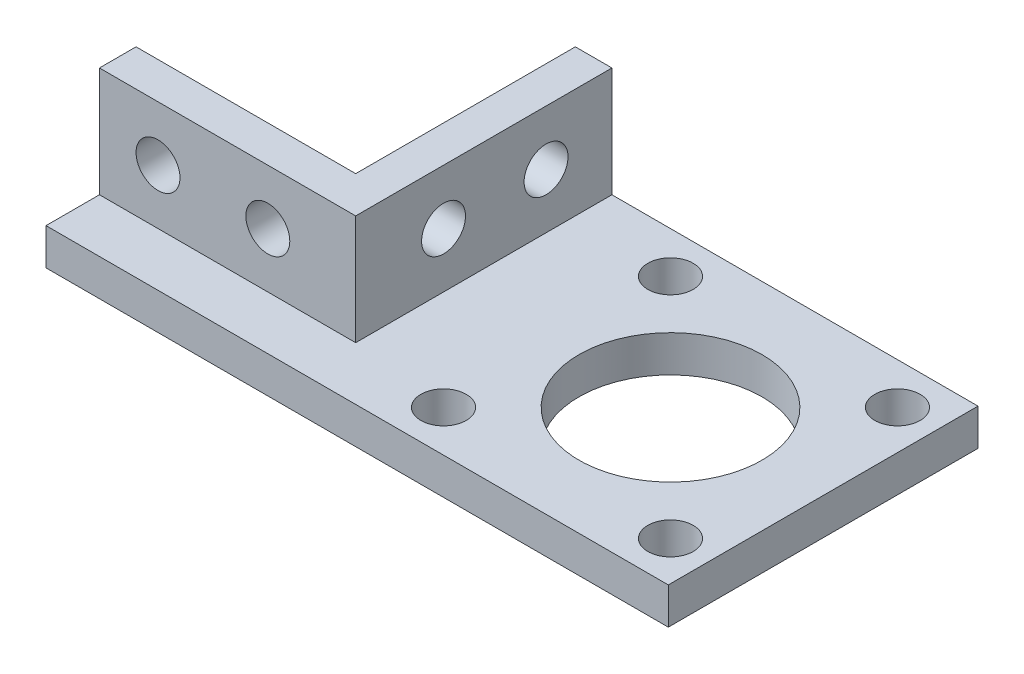
ISO-10303-21;
HEADER;
FILE_DESCRIPTION(('STEP AP214'),'2;1');
FILE_NAME('part.step','',(''),(''),'','','');
FILE_SCHEMA(('AUTOMOTIVE_DESIGN { 1 0 10303 214 1 1 1 1 }'));
ENDSEC;
DATA;
#1=APPLICATION_CONTEXT('core data for automotive mechanical design processes');
#2=APPLICATION_PROTOCOL_DEFINITION('international standard','automotive_design',2000,#1);
#3=PRODUCT_CONTEXT('',#1,'mechanical');
#4=PRODUCT('Part','Part','',(#3));
#5=PRODUCT_RELATED_PRODUCT_CATEGORY('part','',(#4));
#6=PRODUCT_DEFINITION_FORMATION('','',#4);
#7=PRODUCT_DEFINITION_CONTEXT('part definition',#1,'design');
#8=PRODUCT_DEFINITION('design','',#6,#7);
#9=PRODUCT_DEFINITION_SHAPE('','',#8);
#10=(LENGTH_UNIT() NAMED_UNIT(*) SI_UNIT(.MILLI.,.METRE.));
#11=(NAMED_UNIT(*) PLANE_ANGLE_UNIT() SI_UNIT($,.RADIAN.));
#12=(NAMED_UNIT(*) SI_UNIT($,.STERADIAN.) SOLID_ANGLE_UNIT());
#13=UNCERTAINTY_MEASURE_WITH_UNIT(LENGTH_MEASURE(1.E-05),#10,'distance_accuracy_value','');
#14=(GEOMETRIC_REPRESENTATION_CONTEXT(3) GLOBAL_UNCERTAINTY_ASSIGNED_CONTEXT((#13)) GLOBAL_UNIT_ASSIGNED_CONTEXT((#10,
#11,#12)) REPRESENTATION_CONTEXT('',''));
#15=CARTESIAN_POINT('',(0.,0.,0.));
#16=DIRECTION('',(0.,0.,1.));
#17=DIRECTION('',(1.,0.,0.));
#18=AXIS2_PLACEMENT_3D('',#15,#16,#17);
#19=CARTESIAN_POINT('',(0.,0.,5.));
#20=DIRECTION('',(0.,0.,-1.));
#21=DIRECTION('',(-1.,0.,0.));
#22=AXIS2_PLACEMENT_3D('',#19,#20,#21);
#23=PLANE('',#22);
#24=CARTESIAN_POINT('',(-71.2052139280012,-262.5,5.));
#25=DIRECTION('',(0.,0.,1.));
#26=DIRECTION('',(1.,0.,0.));
#27=AXIS2_PLACEMENT_3D('',#24,#25,#26);
#28=CIRCLE('',#27,3.00000000000001);
#29=CARTESIAN_POINT('',(-68.2052139280012,-262.5,5.));
#30=VERTEX_POINT('',#29);
#31=EDGE_CURVE('E169',#30,#30,#28,.T.);
#32=ORIENTED_EDGE('',*,*,#31,.F.);
#33=EDGE_LOOP('',(#32));
#34=FACE_BOUND('',#33,.T.);
#35=CARTESIAN_POINT('',(-86.2052139280012,-262.5,5.));
#36=DIRECTION('',(0.,0.,1.));
#37=DIRECTION('',(1.,0.,0.));
#38=AXIS2_PLACEMENT_3D('',#35,#36,#37);
#39=CIRCLE('',#38,3.00000000000001);
#40=CARTESIAN_POINT('',(-83.2052139280012,-262.5,5.));
#41=VERTEX_POINT('',#40);
#42=EDGE_CURVE('E175',#41,#41,#39,.T.);
#43=ORIENTED_EDGE('',*,*,#42,.F.);
#44=EDGE_LOOP('',(#43));
#45=FACE_BOUND('',#44,.T.);
#46=DIRECTION('',(1.,0.,0.));
#47=VECTOR('',#46,1.);
#48=CARTESIAN_POINT('',(-94.2052139280012,-270.,5.));
#49=LINE('',#48,#47);
#50=CARTESIAN_POINT('',(-94.2052139280012,-270.,5.));
#51=VERTEX_POINT('',#50);
#52=CARTESIAN_POINT('',(-59.2052139280012,-270.,5.));
#53=VERTEX_POINT('',#52);
#54=EDGE_CURVE('E121',#51,#53,#49,.T.);
#55=ORIENTED_EDGE('',*,*,#54,.T.);
#56=DIRECTION('',(0.,1.,0.));
#57=VECTOR('',#56,1.);
#58=CARTESIAN_POINT('',(-59.2052139280012,-275.,5.));
#59=LINE('',#58,#57);
#60=CARTESIAN_POINT('',(-59.2052139280012,-255.,5.));
#61=VERTEX_POINT('',#60);
#62=EDGE_CURVE('E133',#53,#61,#59,.T.);
#63=ORIENTED_EDGE('',*,*,#62,.T.);
#64=DIRECTION('',(-1.,0.,0.));
#65=VECTOR('',#64,1.);
#66=CARTESIAN_POINT('',(-94.2052139280012,-255.,5.));
#67=LINE('',#66,#65);
#68=CARTESIAN_POINT('',(-94.2052139280012,-255.,5.));
#69=VERTEX_POINT('',#68);
#70=EDGE_CURVE('E127',#61,#69,#67,.T.);
#71=ORIENTED_EDGE('',*,*,#70,.T.);
#72=DIRECTION('',(0.,-1.,0.));
#73=VECTOR('',#72,1.);
#74=CARTESIAN_POINT('',(-94.2052139280012,-275.,5.));
#75=LINE('',#74,#73);
#76=EDGE_CURVE('E114',#69,#51,#75,.T.);
#77=ORIENTED_EDGE('',*,*,#76,.T.);
#78=EDGE_LOOP('',(#55,#63,#71,#77));
#79=FACE_BOUND('',#78,.T.);
#80=ADVANCED_FACE('F33',(#34,#45,#79),#23,.F.);
#81=CARTESIAN_POINT('',(-59.2052139280012,-275.,5.));
#82=DIRECTION('',(-1.,0.,0.));
#83=DIRECTION('',(0.,0.,1.));
#84=AXIS2_PLACEMENT_3D('',#81,#82,#83);
#85=PLANE('',#84);
#86=CARTESIAN_POINT('',(-59.2052139280012,-262.5,-20.9999999999999));
#87=DIRECTION('',(1.,0.,0.));
#88=DIRECTION('',(0.,0.,-1.));
#89=AXIS2_PLACEMENT_3D('',#86,#87,#88);
#90=CIRCLE('',#89,3.);
#91=CARTESIAN_POINT('',(-59.2052139280012,-262.5,-23.9999999999999));
#92=VERTEX_POINT('',#91);
#93=EDGE_CURVE('E164',#92,#92,#90,.T.);
#94=ORIENTED_EDGE('',*,*,#93,.F.);
#95=EDGE_LOOP('',(#94));
#96=FACE_BOUND('',#95,.T.);
#97=CARTESIAN_POINT('',(-59.2052139280012,-262.5,-7.));
#98=DIRECTION('',(1.,0.,0.));
#99=DIRECTION('',(0.,0.,-1.));
#100=AXIS2_PLACEMENT_3D('',#97,#98,#99);
#101=CIRCLE('',#100,3.);
#102=CARTESIAN_POINT('',(-59.2052139280012,-262.5,-10.));
#103=VERTEX_POINT('',#102);
#104=EDGE_CURVE('E173',#103,#103,#101,.T.);
#105=ORIENTED_EDGE('',*,*,#104,.F.);
#106=EDGE_LOOP('',(#105));
#107=FACE_BOUND('',#106,.T.);
#108=DIRECTION('',(0.,0.,1.));
#109=VECTOR('',#108,1.);
#110=CARTESIAN_POINT('',(-59.2052139280012,-270.,-29.9999999999999));
#111=LINE('',#110,#109);
#112=CARTESIAN_POINT('',(-59.2052139280012,-270.,-29.9999999999999));
#113=VERTEX_POINT('',#112);
#114=EDGE_CURVE('E50',#113,#53,#111,.T.);
#115=ORIENTED_EDGE('',*,*,#114,.F.);
#116=DIRECTION('',(0.,-1.,0.));
#117=VECTOR('',#116,1.);
#118=CARTESIAN_POINT('',(-59.2052139280012,-275.,-29.9999999999999));
#119=LINE('',#118,#117);
#120=CARTESIAN_POINT('',(-59.2052139280012,-255.,-29.9999999999999));
#121=VERTEX_POINT('',#120);
#122=EDGE_CURVE('E224',#121,#113,#119,.T.);
#123=ORIENTED_EDGE('',*,*,#122,.F.);
#124=DIRECTION('',(0.,0.,-1.));
#125=VECTOR('',#124,1.);
#126=CARTESIAN_POINT('',(-59.2052139280012,-255.,5.));
#127=LINE('',#126,#125);
#128=EDGE_CURVE('E11',#61,#121,#127,.T.);
#129=ORIENTED_EDGE('',*,*,#128,.F.);
#130=ORIENTED_EDGE('',*,*,#62,.F.);
#131=EDGE_LOOP('',(#115,#123,#129,#130));
#132=FACE_BOUND('',#131,.T.);
#133=ADVANCED_FACE('F35',(#96,#107,#132),#85,.F.);
#134=CARTESIAN_POINT('',(-94.2052139280012,-255.,5.));
#135=DIRECTION('',(0.,-1.,0.));
#136=DIRECTION('',(0.,0.,-1.));
#137=AXIS2_PLACEMENT_3D('',#134,#135,#136);
#138=PLANE('',#137);
#139=ORIENTED_EDGE('',*,*,#128,.T.);
#140=DIRECTION('',(1.,0.,0.));
#141=VECTOR('',#140,1.);
#142=CARTESIAN_POINT('',(-64.2052139280012,-255.,-29.9999999999999));
#143=LINE('',#142,#141);
#144=CARTESIAN_POINT('',(-64.2052139280012,-255.,-29.9999999999999));
#145=VERTEX_POINT('',#144);
#146=EDGE_CURVE('E221',#145,#121,#143,.T.);
#147=ORIENTED_EDGE('',*,*,#146,.F.);
#148=DIRECTION('',(0.,0.,1.));
#149=VECTOR('',#148,1.);
#150=CARTESIAN_POINT('',(-64.2052139280012,-255.,-29.9999999999999));
#151=LINE('',#150,#149);
#152=CARTESIAN_POINT('',(-64.2052139280012,-255.,0.));
#153=VERTEX_POINT('',#152);
#154=EDGE_CURVE('E140',#145,#153,#151,.T.);
#155=ORIENTED_EDGE('',*,*,#154,.T.);
#156=DIRECTION('',(-1.,0.,0.));
#157=VECTOR('',#156,1.);
#158=CARTESIAN_POINT('',(-94.2052139280012,-255.,0.));
#159=LINE('',#158,#157);
#160=CARTESIAN_POINT('',(-94.2052139280012,-255.,0.));
#161=VERTEX_POINT('',#160);
#162=EDGE_CURVE('E137',#153,#161,#159,.T.);
#163=ORIENTED_EDGE('',*,*,#162,.T.);
#164=DIRECTION('',(0.,0.,-1.));
#165=VECTOR('',#164,1.);
#166=CARTESIAN_POINT('',(-94.2052139280012,-255.,5.));
#167=LINE('',#166,#165);
#168=EDGE_CURVE('E42',#69,#161,#167,.T.);
#169=ORIENTED_EDGE('',*,*,#168,.F.);
#170=ORIENTED_EDGE('',*,*,#70,.F.);
#171=EDGE_LOOP('',(#139,#147,#155,#163,#169,#170));
#172=FACE_BOUND('',#171,.T.);
#173=ADVANCED_FACE('F235',(#172),#138,.F.);
#174=CARTESIAN_POINT('',(-94.2052139280012,-275.,5.));
#175=DIRECTION('',(1.,0.,0.));
#176=DIRECTION('',(0.,0.,-1.));
#177=AXIS2_PLACEMENT_3D('',#174,#175,#176);
#178=PLANE('',#177);
#179=DIRECTION('',(0.,-1.,0.));
#180=VECTOR('',#179,1.);
#181=CARTESIAN_POINT('',(-94.2052139280012,-275.,0.));
#182=LINE('',#181,#180);
#183=CARTESIAN_POINT('',(-94.2052139280012,-275.,0.));
#184=VERTEX_POINT('',#183);
#185=EDGE_CURVE('E139',#161,#184,#182,.T.);
#186=ORIENTED_EDGE('',*,*,#185,.T.);
#187=DIRECTION('',(0.,0.,-1.));
#188=VECTOR('',#187,1.);
#189=CARTESIAN_POINT('',(-94.2052139280012,-275.,5.));
#190=LINE('',#189,#188);
#191=CARTESIAN_POINT('',(-94.2052139280012,-275.,12.3000000000001));
#192=VERTEX_POINT('',#191);
#193=EDGE_CURVE('E129',#192,#184,#190,.T.);
#194=ORIENTED_EDGE('',*,*,#193,.F.);
#195=DIRECTION('',(0.,1.,0.));
#196=VECTOR('',#195,1.);
#197=CARTESIAN_POINT('',(-94.2052139280012,-275.,12.3000000000001));
#198=LINE('',#197,#196);
#199=CARTESIAN_POINT('',(-94.2052139280012,-270.,12.3000000000001));
#200=VERTEX_POINT('',#199);
#201=EDGE_CURVE('E116',#192,#200,#198,.T.);
#202=ORIENTED_EDGE('',*,*,#201,.T.);
#203=DIRECTION('',(0.,0.,-1.));
#204=VECTOR('',#203,1.);
#205=CARTESIAN_POINT('',(-94.2052139280012,-270.,12.3000000000001));
#206=LINE('',#205,#204);
#207=EDGE_CURVE('E109',#200,#51,#206,.T.);
#208=ORIENTED_EDGE('',*,*,#207,.T.);
#209=ORIENTED_EDGE('',*,*,#76,.F.);
#210=ORIENTED_EDGE('',*,*,#168,.T.);
#211=EDGE_LOOP('',(#186,#194,#202,#208,#209,#210));
#212=FACE_BOUND('',#211,.T.);
#213=ADVANCED_FACE('F111',(#212),#178,.F.);
#214=CARTESIAN_POINT('',(-94.2052139280012,-275.,5.));
#215=DIRECTION('',(0.,1.,0.));
#216=DIRECTION('',(0.,0.,1.));
#217=AXIS2_PLACEMENT_3D('',#214,#215,#216);
#218=PLANE('',#217);
#219=CARTESIAN_POINT('',(-45.5552139280007,-275.,-24.3499999999999));
#220=DIRECTION('',(0.,-1.,0.));
#221=DIRECTION('',(0.,0.,-1.));
#222=AXIS2_PLACEMENT_3D('',#219,#220,#221);
#223=CIRCLE('',#222,3.10000000000003);
#224=CARTESIAN_POINT('',(-45.5552139280007,-275.,-27.4499999999999));
#225=VERTEX_POINT('',#224);
#226=EDGE_CURVE('E192',#225,#225,#223,.T.);
#227=ORIENTED_EDGE('',*,*,#226,.F.);
#228=EDGE_LOOP('',(#227));
#229=FACE_BOUND('',#228,.T.);
#230=CARTESIAN_POINT('',(-45.5552139280007,-275.,6.65000000000014));
#231=DIRECTION('',(0.,-1.,0.));
#232=DIRECTION('',(0.,0.,-1.));
#233=AXIS2_PLACEMENT_3D('',#230,#231,#232);
#234=CIRCLE('',#233,3.10000000000003);
#235=CARTESIAN_POINT('',(-45.5552139280007,-275.,3.55000000000011));
#236=VERTEX_POINT('',#235);
#237=EDGE_CURVE('E191',#236,#236,#234,.T.);
#238=ORIENTED_EDGE('',*,*,#237,.F.);
#239=EDGE_LOOP('',(#238));
#240=FACE_BOUND('',#239,.T.);
#241=CARTESIAN_POINT('',(-30.0552139280019,-275.,-8.85000000000047));
#242=DIRECTION('',(0.,-1.,0.));
#243=DIRECTION('',(0.,0.,-1.));
#244=AXIS2_PLACEMENT_3D('',#241,#242,#243);
#245=CIRCLE('',#244,12.5);
#246=CARTESIAN_POINT('',(-30.0552139280019,-275.,-21.3500000000005));
#247=VERTEX_POINT('',#246);
#248=EDGE_CURVE('E166',#247,#247,#245,.T.);
#249=ORIENTED_EDGE('',*,*,#248,.F.);
#250=EDGE_LOOP('',(#249));
#251=FACE_BOUND('',#250,.T.);
#252=CARTESIAN_POINT('',(-14.5552139280007,-275.,-24.3499999999999));
#253=DIRECTION('',(0.,-1.,0.));
#254=DIRECTION('',(0.,0.,-1.));
#255=AXIS2_PLACEMENT_3D('',#252,#253,#254);
#256=CIRCLE('',#255,3.10000000000002);
#257=CARTESIAN_POINT('',(-14.5552139280007,-275.,-27.4499999999999));
#258=VERTEX_POINT('',#257);
#259=EDGE_CURVE('E188',#258,#258,#256,.T.);
#260=ORIENTED_EDGE('',*,*,#259,.F.);
#261=EDGE_LOOP('',(#260));
#262=FACE_BOUND('',#261,.T.);
#263=CARTESIAN_POINT('',(-14.5552139280007,-275.,6.65000000000014));
#264=DIRECTION('',(0.,-1.,0.));
#265=DIRECTION('',(0.,0.,-1.));
#266=AXIS2_PLACEMENT_3D('',#263,#264,#265);
#267=CIRCLE('',#266,3.10000000000003);
#268=CARTESIAN_POINT('',(-14.5552139280007,-275.,3.55000000000011));
#269=VERTEX_POINT('',#268);
#270=EDGE_CURVE('E149',#269,#269,#267,.T.);
#271=ORIENTED_EDGE('',*,*,#270,.F.);
#272=EDGE_LOOP('',(#271));
#273=FACE_BOUND('',#272,.T.);
#274=DIRECTION('',(1.,0.,0.));
#275=VECTOR('',#274,1.);
#276=CARTESIAN_POINT('',(-94.2052139280012,-275.,0.));
#277=LINE('',#276,#275);
#278=CARTESIAN_POINT('',(-64.2052139280012,-275.,0.));
#279=VERTEX_POINT('',#278);
#280=EDGE_CURVE('E142',#184,#279,#277,.T.);
#281=ORIENTED_EDGE('',*,*,#280,.T.);
#282=DIRECTION('',(0.,0.,1.));
#283=VECTOR('',#282,1.);
#284=CARTESIAN_POINT('',(-64.2052139280012,-275.,-29.9999999999999));
#285=LINE('',#284,#283);
#286=CARTESIAN_POINT('',(-64.2052139280012,-275.,-29.9999999999999));
#287=VERTEX_POINT('',#286);
#288=EDGE_CURVE('E228',#287,#279,#285,.T.);
#289=ORIENTED_EDGE('',*,*,#288,.F.);
#290=DIRECTION('',(-1.,0.,0.));
#291=VECTOR('',#290,1.);
#292=CARTESIAN_POINT('',(-64.2052139280012,-275.,-29.9999999999999));
#293=LINE('',#292,#291);
#294=CARTESIAN_POINT('',(-9.20521392800116,-275.,-29.9999999999999));
#295=VERTEX_POINT('',#294);
#296=EDGE_CURVE('E226',#295,#287,#293,.T.);
#297=ORIENTED_EDGE('',*,*,#296,.F.);
#298=DIRECTION('',(0.,0.,-1.));
#299=VECTOR('',#298,1.);
#300=CARTESIAN_POINT('',(-9.20521392800116,-275.,-29.9999999999999));
#301=LINE('',#300,#299);
#302=CARTESIAN_POINT('',(-9.20521392800116,-275.,12.3000000000001));
#303=VERTEX_POINT('',#302);
#304=EDGE_CURVE('E207',#303,#295,#301,.T.);
#305=ORIENTED_EDGE('',*,*,#304,.F.);
#306=DIRECTION('',(-1.,0.,0.));
#307=VECTOR('',#306,1.);
#308=CARTESIAN_POINT('',(-9.20521392800116,-275.,12.3000000000001));
#309=LINE('',#308,#307);
#310=EDGE_CURVE('E210',#303,#192,#309,.T.);
#311=ORIENTED_EDGE('',*,*,#310,.T.);
#312=ORIENTED_EDGE('',*,*,#193,.T.);
#313=EDGE_LOOP('',(#281,#289,#297,#305,#311,#312));
#314=FACE_BOUND('',#313,.T.);
#315=ADVANCED_FACE('F248',(#229,#240,#251,#262,#273,#314),#218,.F.);
#316=CARTESIAN_POINT('',(0.,0.,0.));
#317=DIRECTION('',(0.,0.,-1.));
#318=DIRECTION('',(-1.,0.,0.));
#319=AXIS2_PLACEMENT_3D('',#316,#317,#318);
#320=PLANE('',#319);
#321=CARTESIAN_POINT('',(-71.2052139280012,-262.5,0.));
#322=DIRECTION('',(0.,0.,-1.));
#323=DIRECTION('',(-1.,0.,0.));
#324=AXIS2_PLACEMENT_3D('',#321,#322,#323);
#325=CIRCLE('',#324,3.00000000000001);
#326=CARTESIAN_POINT('',(-74.2052139280012,-262.5,0.));
#327=VERTEX_POINT('',#326);
#328=EDGE_CURVE('E37',#327,#327,#325,.T.);
#329=ORIENTED_EDGE('',*,*,#328,.F.);
#330=EDGE_LOOP('',(#329));
#331=FACE_BOUND('',#330,.T.);
#332=CARTESIAN_POINT('',(-86.2052139280012,-262.5,0.));
#333=DIRECTION('',(0.,0.,-1.));
#334=DIRECTION('',(-1.,0.,0.));
#335=AXIS2_PLACEMENT_3D('',#332,#333,#334);
#336=CIRCLE('',#335,3.00000000000001);
#337=CARTESIAN_POINT('',(-89.2052139280012,-262.5,0.));
#338=VERTEX_POINT('',#337);
#339=EDGE_CURVE('E167',#338,#338,#336,.T.);
#340=ORIENTED_EDGE('',*,*,#339,.F.);
#341=EDGE_LOOP('',(#340));
#342=FACE_BOUND('',#341,.T.);
#343=DIRECTION('',(0.,1.,0.));
#344=VECTOR('',#343,1.);
#345=CARTESIAN_POINT('',(-64.2052139280012,-275.,0.));
#346=LINE('',#345,#344);
#347=EDGE_CURVE('E58',#279,#153,#346,.T.);
#348=ORIENTED_EDGE('',*,*,#347,.F.);
#349=ORIENTED_EDGE('',*,*,#280,.F.);
#350=ORIENTED_EDGE('',*,*,#185,.F.);
#351=ORIENTED_EDGE('',*,*,#162,.F.);
#352=EDGE_LOOP('',(#348,#349,#350,#351));
#353=FACE_BOUND('',#352,.T.);
#354=ADVANCED_FACE('F252',(#331,#342,#353),#320,.T.);
#355=CARTESIAN_POINT('',(-64.2052139280012,-275.,-29.9999999999999));
#356=DIRECTION('',(1.,0.,0.));
#357=DIRECTION('',(0.,0.,-1.));
#358=AXIS2_PLACEMENT_3D('',#355,#356,#357);
#359=PLANE('',#358);
#360=CARTESIAN_POINT('',(-64.2052139280012,-262.5,-20.9999999999999));
#361=DIRECTION('',(1.,0.,0.));
#362=DIRECTION('',(0.,0.,-1.));
#363=AXIS2_PLACEMENT_3D('',#360,#361,#362);
#364=CIRCLE('',#363,3.);
#365=CARTESIAN_POINT('',(-64.2052139280012,-262.5,-23.9999999999999));
#366=VERTEX_POINT('',#365);
#367=EDGE_CURVE('E163',#366,#366,#364,.T.);
#368=ORIENTED_EDGE('',*,*,#367,.T.);
#369=EDGE_LOOP('',(#368));
#370=FACE_BOUND('',#369,.T.);
#371=CARTESIAN_POINT('',(-64.2052139280012,-262.5,-7.));
#372=DIRECTION('',(1.,0.,0.));
#373=DIRECTION('',(0.,0.,-1.));
#374=AXIS2_PLACEMENT_3D('',#371,#372,#373);
#375=CIRCLE('',#374,3.);
#376=CARTESIAN_POINT('',(-64.2052139280012,-262.5,-10.));
#377=VERTEX_POINT('',#376);
#378=EDGE_CURVE('E160',#377,#377,#375,.T.);
#379=ORIENTED_EDGE('',*,*,#378,.T.);
#380=EDGE_LOOP('',(#379));
#381=FACE_BOUND('',#380,.T.);
#382=ORIENTED_EDGE('',*,*,#347,.T.);
#383=ORIENTED_EDGE('',*,*,#154,.F.);
#384=DIRECTION('',(0.,1.,0.));
#385=VECTOR('',#384,1.);
#386=CARTESIAN_POINT('',(-64.2052139280012,-275.,-29.9999999999999));
#387=LINE('',#386,#385);
#388=EDGE_CURVE('E218',#287,#145,#387,.T.);
#389=ORIENTED_EDGE('',*,*,#388,.F.);
#390=ORIENTED_EDGE('',*,*,#288,.T.);
#391=EDGE_LOOP('',(#382,#383,#389,#390));
#392=FACE_BOUND('',#391,.T.);
#393=ADVANCED_FACE('F250',(#370,#381,#392),#359,.F.);
#394=CARTESIAN_POINT('',(0.,0.,-29.9999999999999));
#395=DIRECTION('',(0.,0.,-1.));
#396=DIRECTION('',(-1.,0.,0.));
#397=AXIS2_PLACEMENT_3D('',#394,#395,#396);
#398=PLANE('',#397);
#399=ORIENTED_EDGE('',*,*,#388,.T.);
#400=ORIENTED_EDGE('',*,*,#146,.T.);
#401=ORIENTED_EDGE('',*,*,#122,.T.);
#402=DIRECTION('',(-1.,0.,0.));
#403=VECTOR('',#402,1.);
#404=CARTESIAN_POINT('',(-9.20521392800116,-270.,-29.9999999999999));
#405=LINE('',#404,#403);
#406=CARTESIAN_POINT('',(-9.20521392800116,-270.,-29.9999999999999));
#407=VERTEX_POINT('',#406);
#408=EDGE_CURVE('E216',#407,#113,#405,.T.);
#409=ORIENTED_EDGE('',*,*,#408,.F.);
#410=DIRECTION('',(0.,1.,0.));
#411=VECTOR('',#410,1.);
#412=CARTESIAN_POINT('',(-9.20521392800116,-275.,-29.9999999999999));
#413=LINE('',#412,#411);
#414=EDGE_CURVE('E200',#295,#407,#413,.T.);
#415=ORIENTED_EDGE('',*,*,#414,.F.);
#416=ORIENTED_EDGE('',*,*,#296,.T.);
#417=EDGE_LOOP('',(#399,#400,#401,#409,#415,#416));
#418=FACE_BOUND('',#417,.T.);
#419=ADVANCED_FACE('F238',(#418),#398,.T.);
#420=CARTESIAN_POINT('',(-9.20521392800116,-270.,-29.9999999999999));
#421=DIRECTION('',(0.,-1.,0.));
#422=DIRECTION('',(0.,0.,-1.));
#423=AXIS2_PLACEMENT_3D('',#420,#421,#422);
#424=PLANE('',#423);
#425=CARTESIAN_POINT('',(-45.5552139280007,-270.,-24.3499999999999));
#426=DIRECTION('',(0.,-1.,0.));
#427=DIRECTION('',(0.,0.,-1.));
#428=AXIS2_PLACEMENT_3D('',#425,#426,#427);
#429=CIRCLE('',#428,3.10000000000003);
#430=CARTESIAN_POINT('',(-45.5552139280007,-270.,-27.4499999999999));
#431=VERTEX_POINT('',#430);
#432=EDGE_CURVE('E119',#431,#431,#429,.T.);
#433=ORIENTED_EDGE('',*,*,#432,.T.);
#434=EDGE_LOOP('',(#433));
#435=FACE_BOUND('',#434,.T.);
#436=CARTESIAN_POINT('',(-45.5552139280007,-270.,6.65000000000014));
#437=DIRECTION('',(0.,-1.,0.));
#438=DIRECTION('',(0.,0.,-1.));
#439=AXIS2_PLACEMENT_3D('',#436,#437,#438);
#440=CIRCLE('',#439,3.10000000000003);
#441=CARTESIAN_POINT('',(-45.5552139280007,-270.,3.55000000000011));
#442=VERTEX_POINT('',#441);
#443=EDGE_CURVE('E155',#442,#442,#440,.T.);
#444=ORIENTED_EDGE('',*,*,#443,.T.);
#445=EDGE_LOOP('',(#444));
#446=FACE_BOUND('',#445,.T.);
#447=CARTESIAN_POINT('',(-30.0552139280019,-270.,-8.85000000000047));
#448=DIRECTION('',(0.,-1.,0.));
#449=DIRECTION('',(0.,0.,-1.));
#450=AXIS2_PLACEMENT_3D('',#447,#448,#449);
#451=CIRCLE('',#450,12.5);
#452=CARTESIAN_POINT('',(-30.0552139280019,-270.,-21.3500000000005));
#453=VERTEX_POINT('',#452);
#454=EDGE_CURVE('E152',#453,#453,#451,.T.);
#455=ORIENTED_EDGE('',*,*,#454,.T.);
#456=EDGE_LOOP('',(#455));
#457=FACE_BOUND('',#456,.T.);
#458=CARTESIAN_POINT('',(-14.5552139280007,-270.,-24.3499999999999));
#459=DIRECTION('',(0.,-1.,0.));
#460=DIRECTION('',(0.,0.,-1.));
#461=AXIS2_PLACEMENT_3D('',#458,#459,#460);
#462=CIRCLE('',#461,3.10000000000002);
#463=CARTESIAN_POINT('',(-14.5552139280007,-270.,-27.4499999999999));
#464=VERTEX_POINT('',#463);
#465=EDGE_CURVE('E148',#464,#464,#462,.T.);
#466=ORIENTED_EDGE('',*,*,#465,.T.);
#467=EDGE_LOOP('',(#466));
#468=FACE_BOUND('',#467,.T.);
#469=CARTESIAN_POINT('',(-14.5552139280007,-270.,6.65000000000014));
#470=DIRECTION('',(0.,-1.,0.));
#471=DIRECTION('',(0.,0.,-1.));
#472=AXIS2_PLACEMENT_3D('',#469,#470,#471);
#473=CIRCLE('',#472,3.10000000000003);
#474=CARTESIAN_POINT('',(-14.5552139280007,-270.,3.55000000000011));
#475=VERTEX_POINT('',#474);
#476=EDGE_CURVE('E145',#475,#475,#473,.T.);
#477=ORIENTED_EDGE('',*,*,#476,.T.);
#478=EDGE_LOOP('',(#477));
#479=FACE_BOUND('',#478,.T.);
#480=ORIENTED_EDGE('',*,*,#114,.T.);
#481=ORIENTED_EDGE('',*,*,#54,.F.);
#482=ORIENTED_EDGE('',*,*,#207,.F.);
#483=DIRECTION('',(-1.,0.,0.));
#484=VECTOR('',#483,1.);
#485=CARTESIAN_POINT('',(-9.20521392800116,-270.,12.3000000000001));
#486=LINE('',#485,#484);
#487=CARTESIAN_POINT('',(-9.20521392800116,-270.,12.3000000000001));
#488=VERTEX_POINT('',#487);
#489=EDGE_CURVE('E214',#488,#200,#486,.T.);
#490=ORIENTED_EDGE('',*,*,#489,.F.);
#491=DIRECTION('',(0.,0.,1.));
#492=VECTOR('',#491,1.);
#493=CARTESIAN_POINT('',(-9.20521392800116,-270.,-29.9999999999999));
#494=LINE('',#493,#492);
#495=EDGE_CURVE('E203',#407,#488,#494,.T.);
#496=ORIENTED_EDGE('',*,*,#495,.F.);
#497=ORIENTED_EDGE('',*,*,#408,.T.);
#498=EDGE_LOOP('',(#480,#481,#482,#490,#496,#497));
#499=FACE_BOUND('',#498,.T.);
#500=ADVANCED_FACE('F122',(#435,#446,#457,#468,#479,#499),#424,.F.);
#501=CARTESIAN_POINT('',(-9.20521392800116,-275.,12.3000000000001));
#502=DIRECTION('',(0.,0.,-1.));
#503=DIRECTION('',(-1.,0.,0.));
#504=AXIS2_PLACEMENT_3D('',#501,#502,#503);
#505=PLANE('',#504);
#506=ORIENTED_EDGE('',*,*,#489,.T.);
#507=ORIENTED_EDGE('',*,*,#201,.F.);
#508=ORIENTED_EDGE('',*,*,#310,.F.);
#509=DIRECTION('',(0.,-1.,0.));
#510=VECTOR('',#509,1.);
#511=CARTESIAN_POINT('',(-9.20521392800116,-275.,12.3000000000001));
#512=LINE('',#511,#510);
#513=EDGE_CURVE('E205',#488,#303,#512,.T.);
#514=ORIENTED_EDGE('',*,*,#513,.F.);
#515=EDGE_LOOP('',(#506,#507,#508,#514));
#516=FACE_BOUND('',#515,.T.);
#517=ADVANCED_FACE('F279',(#516),#505,.F.);
#518=CARTESIAN_POINT('',(-9.20521392800116,0.,0.));
#519=DIRECTION('',(1.,0.,0.));
#520=DIRECTION('',(0.,0.,-1.));
#521=AXIS2_PLACEMENT_3D('',#518,#519,#520);
#522=PLANE('',#521);
#523=ORIENTED_EDGE('',*,*,#414,.T.);
#524=ORIENTED_EDGE('',*,*,#495,.T.);
#525=ORIENTED_EDGE('',*,*,#513,.T.);
#526=ORIENTED_EDGE('',*,*,#304,.T.);
#527=EDGE_LOOP('',(#523,#524,#525,#526));
#528=FACE_BOUND('',#527,.T.);
#529=ADVANCED_FACE('F242',(#528),#522,.T.);
#530=CARTESIAN_POINT('',(-14.5552139280007,-236.,6.65000000000014));
#531=DIRECTION('',(0.,-1.,0.));
#532=DIRECTION('',(0.,0.,-1.));
#533=AXIS2_PLACEMENT_3D('',#530,#531,#532);
#534=CYLINDRICAL_SURFACE('',#533,3.10000000000003);
#535=ORIENTED_EDGE('',*,*,#270,.T.);
#536=EDGE_LOOP('',(#535));
#537=FACE_BOUND('',#536,.T.);
#538=ORIENTED_EDGE('',*,*,#476,.F.);
#539=EDGE_LOOP('',(#538));
#540=FACE_BOUND('',#539,.T.);
#541=ADVANCED_FACE('F286',(#537,#540),#534,.F.);
#542=CARTESIAN_POINT('',(-14.5552139280007,-236.,-24.3499999999999));
#543=DIRECTION('',(0.,-1.,0.));
#544=DIRECTION('',(0.,0.,-1.));
#545=AXIS2_PLACEMENT_3D('',#542,#543,#544);
#546=CYLINDRICAL_SURFACE('',#545,3.10000000000002);
#547=ORIENTED_EDGE('',*,*,#259,.T.);
#548=EDGE_LOOP('',(#547));
#549=FACE_BOUND('',#548,.T.);
#550=ORIENTED_EDGE('',*,*,#465,.F.);
#551=EDGE_LOOP('',(#550));
#552=FACE_BOUND('',#551,.T.);
#553=ADVANCED_FACE('F289',(#549,#552),#546,.F.);
#554=CARTESIAN_POINT('',(-30.0552139280019,-236.,-8.85000000000047));
#555=DIRECTION('',(0.,-1.,0.));
#556=DIRECTION('',(0.,0.,-1.));
#557=AXIS2_PLACEMENT_3D('',#554,#555,#556);
#558=CYLINDRICAL_SURFACE('',#557,12.5);
#559=ORIENTED_EDGE('',*,*,#248,.T.);
#560=EDGE_LOOP('',(#559));
#561=FACE_BOUND('',#560,.T.);
#562=ORIENTED_EDGE('',*,*,#454,.F.);
#563=EDGE_LOOP('',(#562));
#564=FACE_BOUND('',#563,.T.);
#565=ADVANCED_FACE('F295',(#561,#564),#558,.F.);
#566=CARTESIAN_POINT('',(-45.5552139280007,-236.,6.65000000000014));
#567=DIRECTION('',(0.,-1.,0.));
#568=DIRECTION('',(0.,0.,-1.));
#569=AXIS2_PLACEMENT_3D('',#566,#567,#568);
#570=CYLINDRICAL_SURFACE('',#569,3.10000000000003);
#571=ORIENTED_EDGE('',*,*,#237,.T.);
#572=EDGE_LOOP('',(#571));
#573=FACE_BOUND('',#572,.T.);
#574=ORIENTED_EDGE('',*,*,#443,.F.);
#575=EDGE_LOOP('',(#574));
#576=FACE_BOUND('',#575,.T.);
#577=ADVANCED_FACE('F291',(#573,#576),#570,.F.);
#578=CARTESIAN_POINT('',(-45.5552139280007,-236.,-24.3499999999999));
#579=DIRECTION('',(0.,-1.,0.));
#580=DIRECTION('',(0.,0.,-1.));
#581=AXIS2_PLACEMENT_3D('',#578,#579,#580);
#582=CYLINDRICAL_SURFACE('',#581,3.10000000000003);
#583=ORIENTED_EDGE('',*,*,#226,.T.);
#584=EDGE_LOOP('',(#583));
#585=FACE_BOUND('',#584,.T.);
#586=ORIENTED_EDGE('',*,*,#432,.F.);
#587=EDGE_LOOP('',(#586));
#588=FACE_BOUND('',#587,.T.);
#589=ADVANCED_FACE('F294',(#585,#588),#582,.F.);
#590=CARTESIAN_POINT('',(-94.2052139280012,-262.5,-7.));
#591=DIRECTION('',(1.,0.,0.));
#592=DIRECTION('',(0.,0.,-1.));
#593=AXIS2_PLACEMENT_3D('',#590,#591,#592);
#594=CYLINDRICAL_SURFACE('',#593,3.);
#595=ORIENTED_EDGE('',*,*,#104,.T.);
#596=EDGE_LOOP('',(#595));
#597=FACE_BOUND('',#596,.T.);
#598=ORIENTED_EDGE('',*,*,#378,.F.);
#599=EDGE_LOOP('',(#598));
#600=FACE_BOUND('',#599,.T.);
#601=ADVANCED_FACE('F299',(#597,#600),#594,.F.);
#602=CARTESIAN_POINT('',(-94.2052139280012,-262.5,-20.9999999999999));
#603=DIRECTION('',(1.,0.,0.));
#604=DIRECTION('',(0.,0.,-1.));
#605=AXIS2_PLACEMENT_3D('',#602,#603,#604);
#606=CYLINDRICAL_SURFACE('',#605,3.);
#607=ORIENTED_EDGE('',*,*,#93,.T.);
#608=EDGE_LOOP('',(#607));
#609=FACE_BOUND('',#608,.T.);
#610=ORIENTED_EDGE('',*,*,#367,.F.);
#611=EDGE_LOOP('',(#610));
#612=FACE_BOUND('',#611,.T.);
#613=ADVANCED_FACE('F309',(#609,#612),#606,.F.);
#614=CARTESIAN_POINT('',(-86.2052139280012,-262.5,-5.));
#615=DIRECTION('',(0.,0.,1.));
#616=DIRECTION('',(1.,0.,0.));
#617=AXIS2_PLACEMENT_3D('',#614,#615,#616);
#618=CYLINDRICAL_SURFACE('',#617,3.00000000000001);
#619=ORIENTED_EDGE('',*,*,#339,.T.);
#620=EDGE_LOOP('',(#619));
#621=FACE_BOUND('',#620,.T.);
#622=ORIENTED_EDGE('',*,*,#42,.T.);
#623=EDGE_LOOP('',(#622));
#624=FACE_BOUND('',#623,.T.);
#625=ADVANCED_FACE('F313',(#621,#624),#618,.F.);
#626=CARTESIAN_POINT('',(-71.2052139280012,-262.5,-5.));
#627=DIRECTION('',(0.,0.,1.));
#628=DIRECTION('',(1.,0.,0.));
#629=AXIS2_PLACEMENT_3D('',#626,#627,#628);
#630=CYLINDRICAL_SURFACE('',#629,3.00000000000001);
#631=ORIENTED_EDGE('',*,*,#328,.T.);
#632=EDGE_LOOP('',(#631));
#633=FACE_BOUND('',#632,.T.);
#634=ORIENTED_EDGE('',*,*,#31,.T.);
#635=EDGE_LOOP('',(#634));
#636=FACE_BOUND('',#635,.T.);
#637=ADVANCED_FACE('F317',(#633,#636),#630,.F.);
#638=CLOSED_SHELL('',(#80,#133,#173,#213,#315,#354,#393,#419,#500,#517,#529,#541,#553,#565,#577,
#589,#601,#613,#625,#637));
#639=MANIFOLD_SOLID_BREP('B2',#638);
#640=ADVANCED_BREP_SHAPE_REPRESENTATION('',(#18,#639),#14);
#641=SHAPE_DEFINITION_REPRESENTATION(#9,#640);
ENDSEC;
END-ISO-10303-21;
